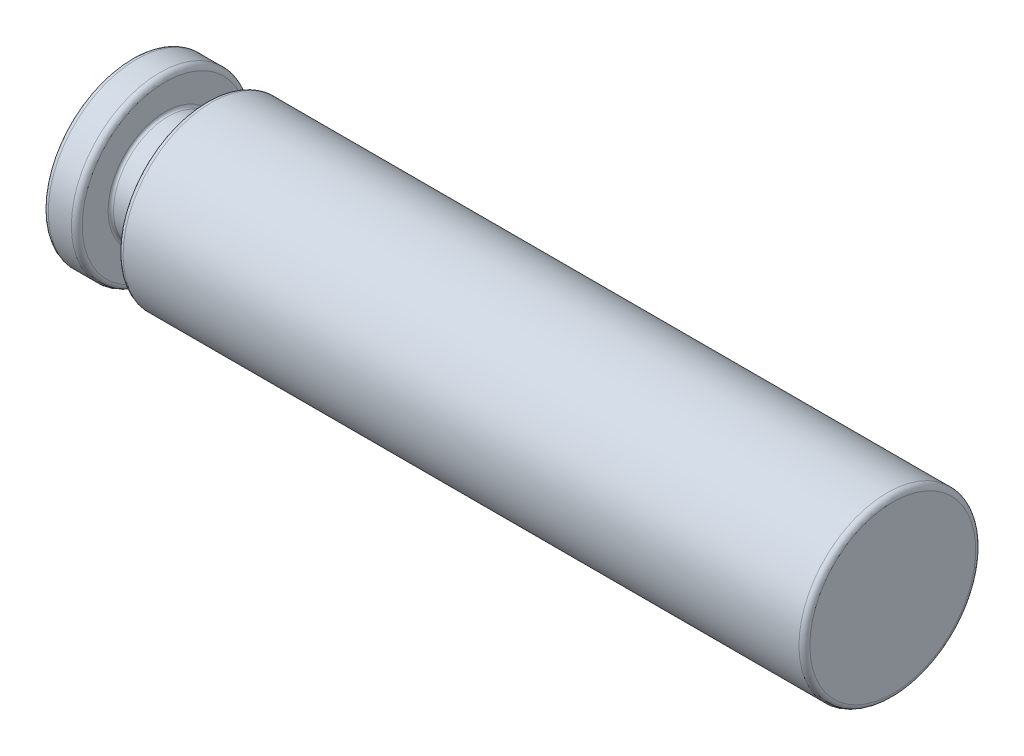
ISO-10303-21;
HEADER;
FILE_DESCRIPTION(('STEP AP214'),'2;1');
FILE_NAME('part.step','',(''),(''),'','','');
FILE_SCHEMA(('AUTOMOTIVE_DESIGN { 1 0 10303 214 1 1 1 1 }'));
ENDSEC;
DATA;
#1=APPLICATION_CONTEXT('core data for automotive mechanical design processes');
#2=APPLICATION_PROTOCOL_DEFINITION('international standard','automotive_design',2000,#1);
#3=PRODUCT_CONTEXT('',#1,'mechanical');
#4=PRODUCT('Part','Part','',(#3));
#5=PRODUCT_RELATED_PRODUCT_CATEGORY('part','',(#4));
#6=PRODUCT_DEFINITION_FORMATION('','',#4);
#7=PRODUCT_DEFINITION_CONTEXT('part definition',#1,'design');
#8=PRODUCT_DEFINITION('design','',#6,#7);
#9=PRODUCT_DEFINITION_SHAPE('','',#8);
#10=(LENGTH_UNIT() NAMED_UNIT(*) SI_UNIT(.MILLI.,.METRE.));
#11=(NAMED_UNIT(*) PLANE_ANGLE_UNIT() SI_UNIT($,.RADIAN.));
#12=(NAMED_UNIT(*) SI_UNIT($,.STERADIAN.) SOLID_ANGLE_UNIT());
#13=UNCERTAINTY_MEASURE_WITH_UNIT(LENGTH_MEASURE(1.E-05),#10,'distance_accuracy_value','');
#14=(GEOMETRIC_REPRESENTATION_CONTEXT(3) GLOBAL_UNCERTAINTY_ASSIGNED_CONTEXT((#13)) GLOBAL_UNIT_ASSIGNED_CONTEXT((#10,
#11,#12)) REPRESENTATION_CONTEXT('',''));
#15=CARTESIAN_POINT('',(0.,0.,0.));
#16=DIRECTION('',(0.,0.,1.));
#17=DIRECTION('',(1.,0.,0.));
#18=AXIS2_PLACEMENT_3D('',#15,#16,#17);
#19=CARTESIAN_POINT('',(112.,12.2,0.));
#20=DIRECTION('',(-1.,0.,0.));
#21=DIRECTION('',(0.,0.,1.));
#22=AXIS2_PLACEMENT_3D('',#19,#20,#21);
#23=PLANE('',#22);
#24=CARTESIAN_POINT('',(112.,0.,0.));
#25=DIRECTION('',(-1.,0.,0.));
#26=DIRECTION('',(0.,0.,1.));
#27=AXIS2_PLACEMENT_3D('',#24,#25,#26);
#28=CIRCLE('',#27,12.2);
#29=CARTESIAN_POINT('',(112.,0.,12.2));
#30=VERTEX_POINT('',#29);
#31=EDGE_CURVE('E10',#30,#30,#28,.T.);
#32=ORIENTED_EDGE('',*,*,#31,.F.);
#33=EDGE_LOOP('',(#32));
#34=FACE_BOUND('',#33,.T.);
#35=ADVANCED_FACE('F39',(#34),#23,.F.);
#36=CARTESIAN_POINT('',(111.2,0.,0.));
#37=DIRECTION('',(-1.,0.,0.));
#38=DIRECTION('',(0.,0.,1.));
#39=AXIS2_PLACEMENT_3D('',#36,#37,#38);
#40=TOROIDAL_SURFACE('',#39,12.2,0.799999999999999);
#41=CARTESIAN_POINT('',(111.2,0.,0.));
#42=DIRECTION('',(-1.,0.,0.));
#43=DIRECTION('',(0.,0.,1.));
#44=AXIS2_PLACEMENT_3D('',#41,#42,#43);
#45=CIRCLE('',#44,13.);
#46=CARTESIAN_POINT('',(111.2,0.,13.));
#47=VERTEX_POINT('',#46);
#48=EDGE_CURVE('E45',#47,#47,#45,.T.);
#49=ORIENTED_EDGE('',*,*,#48,.F.);
#50=EDGE_LOOP('',(#49));
#51=FACE_BOUND('',#50,.T.);
#52=ORIENTED_EDGE('',*,*,#31,.T.);
#53=EDGE_LOOP('',(#52));
#54=FACE_BOUND('',#53,.T.);
#55=ADVANCED_FACE('F141',(#51,#54),#40,.T.);
#56=CARTESIAN_POINT('',(0.,0.,0.));
#57=DIRECTION('',(-1.,0.,0.));
#58=DIRECTION('',(0.,0.,1.));
#59=AXIS2_PLACEMENT_3D('',#56,#57,#58);
#60=CYLINDRICAL_SURFACE('',#59,13.);
#61=CARTESIAN_POINT('',(11.8,0.,0.));
#62=DIRECTION('',(-1.,0.,0.));
#63=DIRECTION('',(0.,0.,1.));
#64=AXIS2_PLACEMENT_3D('',#61,#62,#63);
#65=CIRCLE('',#64,13.);
#66=CARTESIAN_POINT('',(11.8,0.,13.));
#67=VERTEX_POINT('',#66);
#68=EDGE_CURVE('E49',#67,#67,#65,.T.);
#69=ORIENTED_EDGE('',*,*,#68,.F.);
#70=EDGE_LOOP('',(#69));
#71=FACE_BOUND('',#70,.T.);
#72=ORIENTED_EDGE('',*,*,#48,.T.);
#73=EDGE_LOOP('',(#72));
#74=FACE_BOUND('',#73,.T.);
#75=ADVANCED_FACE('F136',(#71,#74),#60,.T.);
#76=CARTESIAN_POINT('',(11.8,0.,0.));
#77=DIRECTION('',(-1.,0.,0.));
#78=DIRECTION('',(0.,0.,1.));
#79=AXIS2_PLACEMENT_3D('',#76,#77,#78);
#80=TOROIDAL_SURFACE('',#79,12.2,0.8);
#81=CARTESIAN_POINT('',(11.,0.,0.));
#82=DIRECTION('',(-1.,0.,0.));
#83=DIRECTION('',(0.,0.,1.));
#84=AXIS2_PLACEMENT_3D('',#81,#82,#83);
#85=CIRCLE('',#84,12.2);
#86=CARTESIAN_POINT('',(11.,0.,12.2));
#87=VERTEX_POINT('',#86);
#88=EDGE_CURVE('E53',#87,#87,#85,.T.);
#89=ORIENTED_EDGE('',*,*,#88,.F.);
#90=EDGE_LOOP('',(#89));
#91=FACE_BOUND('',#90,.T.);
#92=ORIENTED_EDGE('',*,*,#68,.T.);
#93=EDGE_LOOP('',(#92));
#94=FACE_BOUND('',#93,.T.);
#95=ADVANCED_FACE('F130',(#91,#94),#80,.T.);
#96=CARTESIAN_POINT('',(11.,8.4,0.));
#97=DIRECTION('',(1.,0.,0.));
#98=DIRECTION('',(0.,0.,-1.));
#99=AXIS2_PLACEMENT_3D('',#96,#97,#98);
#100=PLANE('',#99);
#101=CARTESIAN_POINT('',(11.,0.,0.));
#102=DIRECTION('',(-1.,0.,0.));
#103=DIRECTION('',(0.,0.,1.));
#104=AXIS2_PLACEMENT_3D('',#101,#102,#103);
#105=CIRCLE('',#104,8.4);
#106=CARTESIAN_POINT('',(11.,0.,8.4));
#107=VERTEX_POINT('',#106);
#108=EDGE_CURVE('E58',#107,#107,#105,.T.);
#109=ORIENTED_EDGE('',*,*,#108,.F.);
#110=EDGE_LOOP('',(#109));
#111=FACE_BOUND('',#110,.T.);
#112=ORIENTED_EDGE('',*,*,#88,.T.);
#113=EDGE_LOOP('',(#112));
#114=FACE_BOUND('',#113,.T.);
#115=ADVANCED_FACE('F124',(#111,#114),#100,.F.);
#116=CARTESIAN_POINT('',(10.6,0.,0.));
#117=DIRECTION('',(-1.,0.,0.));
#118=DIRECTION('',(0.,0.,1.));
#119=AXIS2_PLACEMENT_3D('',#116,#117,#118);
#120=TOROIDAL_SURFACE('',#119,8.4,0.399999999999999);
#121=CARTESIAN_POINT('',(10.6,0.,0.));
#122=DIRECTION('',(-1.,0.,0.));
#123=DIRECTION('',(0.,0.,1.));
#124=AXIS2_PLACEMENT_3D('',#121,#122,#123);
#125=CIRCLE('',#124,8.);
#126=CARTESIAN_POINT('',(10.6,0.,8.));
#127=VERTEX_POINT('',#126);
#128=EDGE_CURVE('E61',#127,#127,#125,.T.);
#129=ORIENTED_EDGE('',*,*,#128,.F.);
#130=EDGE_LOOP('',(#129));
#131=FACE_BOUND('',#130,.T.);
#132=ORIENTED_EDGE('',*,*,#108,.T.);
#133=EDGE_LOOP('',(#132));
#134=FACE_BOUND('',#133,.T.);
#135=ADVANCED_FACE('F118',(#131,#134),#120,.F.);
#136=CARTESIAN_POINT('',(0.,0.,0.));
#137=DIRECTION('',(-1.,0.,0.));
#138=DIRECTION('',(0.,0.,1.));
#139=AXIS2_PLACEMENT_3D('',#136,#137,#138);
#140=CYLINDRICAL_SURFACE('',#139,8.);
#141=CARTESIAN_POINT('',(5.4,0.,0.));
#142=DIRECTION('',(-1.,0.,0.));
#143=DIRECTION('',(0.,0.,1.));
#144=AXIS2_PLACEMENT_3D('',#141,#142,#143);
#145=CIRCLE('',#144,8.);
#146=CARTESIAN_POINT('',(5.4,0.,8.));
#147=VERTEX_POINT('',#146);
#148=EDGE_CURVE('E64',#147,#147,#145,.T.);
#149=ORIENTED_EDGE('',*,*,#148,.F.);
#150=EDGE_LOOP('',(#149));
#151=FACE_BOUND('',#150,.T.);
#152=ORIENTED_EDGE('',*,*,#128,.T.);
#153=EDGE_LOOP('',(#152));
#154=FACE_BOUND('',#153,.T.);
#155=ADVANCED_FACE('F112',(#151,#154),#140,.T.);
#156=CARTESIAN_POINT('',(5.4,0.,0.));
#157=DIRECTION('',(-1.,0.,0.));
#158=DIRECTION('',(0.,0.,1.));
#159=AXIS2_PLACEMENT_3D('',#156,#157,#158);
#160=TOROIDAL_SURFACE('',#159,8.4,0.399999999999999);
#161=CARTESIAN_POINT('',(5.,0.,0.));
#162=DIRECTION('',(-1.,0.,0.));
#163=DIRECTION('',(0.,0.,1.));
#164=AXIS2_PLACEMENT_3D('',#161,#162,#163);
#165=CIRCLE('',#164,8.4);
#166=CARTESIAN_POINT('',(5.,0.,8.4));
#167=VERTEX_POINT('',#166);
#168=EDGE_CURVE('E67',#167,#167,#165,.T.);
#169=ORIENTED_EDGE('',*,*,#168,.F.);
#170=EDGE_LOOP('',(#169));
#171=FACE_BOUND('',#170,.T.);
#172=ORIENTED_EDGE('',*,*,#148,.T.);
#173=EDGE_LOOP('',(#172));
#174=FACE_BOUND('',#173,.T.);
#175=ADVANCED_FACE('F106',(#171,#174),#160,.F.);
#176=CARTESIAN_POINT('',(5.,12.2,0.));
#177=DIRECTION('',(-1.,0.,0.));
#178=DIRECTION('',(0.,0.,1.));
#179=AXIS2_PLACEMENT_3D('',#176,#177,#178);
#180=PLANE('',#179);
#181=CARTESIAN_POINT('',(5.,0.,0.));
#182=DIRECTION('',(-1.,0.,0.));
#183=DIRECTION('',(0.,0.,1.));
#184=AXIS2_PLACEMENT_3D('',#181,#182,#183);
#185=CIRCLE('',#184,12.2);
#186=CARTESIAN_POINT('',(5.,0.,12.2));
#187=VERTEX_POINT('',#186);
#188=EDGE_CURVE('E70',#187,#187,#185,.T.);
#189=ORIENTED_EDGE('',*,*,#188,.F.);
#190=EDGE_LOOP('',(#189));
#191=FACE_BOUND('',#190,.T.);
#192=ORIENTED_EDGE('',*,*,#168,.T.);
#193=EDGE_LOOP('',(#192));
#194=FACE_BOUND('',#193,.T.);
#195=ADVANCED_FACE('F100',(#191,#194),#180,.F.);
#196=CARTESIAN_POINT('',(4.2,0.,0.));
#197=DIRECTION('',(-1.,0.,0.));
#198=DIRECTION('',(0.,0.,1.));
#199=AXIS2_PLACEMENT_3D('',#196,#197,#198);
#200=TOROIDAL_SURFACE('',#199,12.2,0.8);
#201=CARTESIAN_POINT('',(4.2,0.,0.));
#202=DIRECTION('',(-1.,0.,0.));
#203=DIRECTION('',(0.,0.,1.));
#204=AXIS2_PLACEMENT_3D('',#201,#202,#203);
#205=CIRCLE('',#204,13.);
#206=CARTESIAN_POINT('',(4.2,0.,13.));
#207=VERTEX_POINT('',#206);
#208=EDGE_CURVE('E73',#207,#207,#205,.T.);
#209=ORIENTED_EDGE('',*,*,#208,.F.);
#210=EDGE_LOOP('',(#209));
#211=FACE_BOUND('',#210,.T.);
#212=ORIENTED_EDGE('',*,*,#188,.T.);
#213=EDGE_LOOP('',(#212));
#214=FACE_BOUND('',#213,.T.);
#215=ADVANCED_FACE('F94',(#211,#214),#200,.T.);
#216=CARTESIAN_POINT('',(0.,0.,0.));
#217=DIRECTION('',(-1.,0.,0.));
#218=DIRECTION('',(0.,0.,1.));
#219=AXIS2_PLACEMENT_3D('',#216,#217,#218);
#220=CYLINDRICAL_SURFACE('',#219,13.);
#221=CARTESIAN_POINT('',(0.8,0.,0.));
#222=DIRECTION('',(-1.,0.,0.));
#223=DIRECTION('',(0.,0.,1.));
#224=AXIS2_PLACEMENT_3D('',#221,#222,#223);
#225=CIRCLE('',#224,13.);
#226=CARTESIAN_POINT('',(0.8,0.,13.));
#227=VERTEX_POINT('',#226);
#228=EDGE_CURVE('E76',#227,#227,#225,.T.);
#229=ORIENTED_EDGE('',*,*,#228,.F.);
#230=EDGE_LOOP('',(#229));
#231=FACE_BOUND('',#230,.T.);
#232=ORIENTED_EDGE('',*,*,#208,.T.);
#233=EDGE_LOOP('',(#232));
#234=FACE_BOUND('',#233,.T.);
#235=ADVANCED_FACE('F88',(#231,#234),#220,.T.);
#236=CARTESIAN_POINT('',(0.8,0.,0.));
#237=DIRECTION('',(-1.,0.,0.));
#238=DIRECTION('',(0.,0.,1.));
#239=AXIS2_PLACEMENT_3D('',#236,#237,#238);
#240=TOROIDAL_SURFACE('',#239,12.2,0.800000000000001);
#241=CARTESIAN_POINT('',(0.,0.,0.));
#242=DIRECTION('',(-1.,0.,0.));
#243=DIRECTION('',(0.,0.,1.));
#244=AXIS2_PLACEMENT_3D('',#241,#242,#243);
#245=CIRCLE('',#244,12.2);
#246=CARTESIAN_POINT('',(0.,0.,12.2));
#247=VERTEX_POINT('',#246);
#248=EDGE_CURVE('E79',#247,#247,#245,.T.);
#249=ORIENTED_EDGE('',*,*,#248,.F.);
#250=EDGE_LOOP('',(#249));
#251=FACE_BOUND('',#250,.T.);
#252=ORIENTED_EDGE('',*,*,#228,.T.);
#253=EDGE_LOOP('',(#252));
#254=FACE_BOUND('',#253,.T.);
#255=ADVANCED_FACE('F85',(#251,#254),#240,.T.);
#256=CARTESIAN_POINT('',(0.,0.,0.));
#257=DIRECTION('',(1.,0.,0.));
#258=DIRECTION('',(0.,0.,-1.));
#259=AXIS2_PLACEMENT_3D('',#256,#257,#258);
#260=PLANE('',#259);
#261=ORIENTED_EDGE('',*,*,#248,.T.);
#262=EDGE_LOOP('',(#261));
#263=FACE_BOUND('',#262,.T.);
#264=ADVANCED_FACE('F83',(#263),#260,.F.);
#265=CLOSED_SHELL('',(#35,#55,#75,#95,#115,#135,#155,#175,#195,#215,#235,#255,#264));
#266=MANIFOLD_SOLID_BREP('B2',#265);
#267=ADVANCED_BREP_SHAPE_REPRESENTATION('',(#18,#266),#14);
#268=SHAPE_DEFINITION_REPRESENTATION(#9,#267);
ENDSEC;
END-ISO-10303-21;
